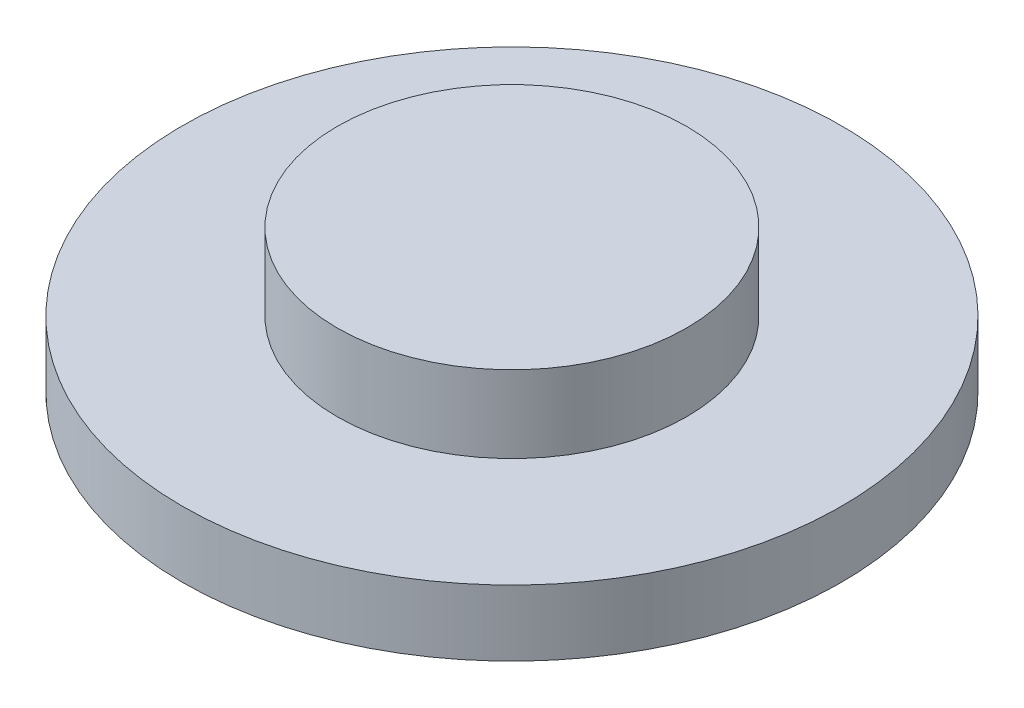
ISO-10303-21;
HEADER;
FILE_DESCRIPTION(('STEP AP214'),'2;1');
FILE_NAME('part.step','',(''),(''),'','','');
FILE_SCHEMA(('AUTOMOTIVE_DESIGN { 1 0 10303 214 1 1 1 1 }'));
ENDSEC;
DATA;
#1=APPLICATION_CONTEXT('core data for automotive mechanical design processes');
#2=APPLICATION_PROTOCOL_DEFINITION('international standard','automotive_design',2000,#1);
#3=PRODUCT_CONTEXT('',#1,'mechanical');
#4=PRODUCT('Part','Part','',(#3));
#5=PRODUCT_RELATED_PRODUCT_CATEGORY('part','',(#4));
#6=PRODUCT_DEFINITION_FORMATION('','',#4);
#7=PRODUCT_DEFINITION_CONTEXT('part definition',#1,'design');
#8=PRODUCT_DEFINITION('design','',#6,#7);
#9=PRODUCT_DEFINITION_SHAPE('','',#8);
#10=(LENGTH_UNIT() NAMED_UNIT(*) SI_UNIT(.MILLI.,.METRE.));
#11=(NAMED_UNIT(*) PLANE_ANGLE_UNIT() SI_UNIT($,.RADIAN.));
#12=(NAMED_UNIT(*) SI_UNIT($,.STERADIAN.) SOLID_ANGLE_UNIT());
#13=UNCERTAINTY_MEASURE_WITH_UNIT(LENGTH_MEASURE(1.E-05),#10,'distance_accuracy_value','');
#14=(GEOMETRIC_REPRESENTATION_CONTEXT(3) GLOBAL_UNCERTAINTY_ASSIGNED_CONTEXT((#13)) GLOBAL_UNIT_ASSIGNED_CONTEXT((#10,
#11,#12)) REPRESENTATION_CONTEXT('',''));
#15=CARTESIAN_POINT('',(0.,0.,0.));
#16=DIRECTION('',(0.,0.,1.));
#17=DIRECTION('',(1.,0.,0.));
#18=AXIS2_PLACEMENT_3D('',#15,#16,#17);
#19=CARTESIAN_POINT('',(0.,3.,0.));
#20=DIRECTION('',(0.,-1.,0.));
#21=DIRECTION('',(0.,0.,-1.));
#22=AXIS2_PLACEMENT_3D('',#19,#20,#21);
#23=CYLINDRICAL_SURFACE('',#22,15.);
#24=CARTESIAN_POINT('',(0.,3.,0.));
#25=DIRECTION('',(0.,1.,0.));
#26=DIRECTION('',(0.,0.,1.));
#27=AXIS2_PLACEMENT_3D('',#24,#25,#26);
#28=CIRCLE('',#27,15.);
#29=CARTESIAN_POINT('',(0.,3.,15.));
#30=VERTEX_POINT('',#29);
#31=EDGE_CURVE('E46',#30,#30,#28,.T.);
#32=ORIENTED_EDGE('',*,*,#31,.F.);
#33=EDGE_LOOP('',(#32));
#34=FACE_BOUND('',#33,.T.);
#35=CARTESIAN_POINT('',(0.,0.,0.));
#36=DIRECTION('',(0.,1.,0.));
#37=DIRECTION('',(0.,0.,1.));
#38=AXIS2_PLACEMENT_3D('',#35,#36,#37);
#39=CIRCLE('',#38,15.);
#40=CARTESIAN_POINT('',(0.,0.,15.));
#41=VERTEX_POINT('',#40);
#42=EDGE_CURVE('E42',#41,#41,#39,.T.);
#43=ORIENTED_EDGE('',*,*,#42,.T.);
#44=EDGE_LOOP('',(#43));
#45=FACE_BOUND('',#44,.T.);
#46=ADVANCED_FACE('F39',(#34,#45),#23,.T.);
#47=CARTESIAN_POINT('',(0.,3.,0.));
#48=DIRECTION('',(0.,1.,0.));
#49=DIRECTION('',(0.,0.,1.));
#50=AXIS2_PLACEMENT_3D('',#47,#48,#49);
#51=PLANE('',#50);
#52=CARTESIAN_POINT('',(0.,3.,0.));
#53=DIRECTION('',(0.,1.,0.));
#54=DIRECTION('',(0.,0.,1.));
#55=AXIS2_PLACEMENT_3D('',#52,#53,#54);
#56=CIRCLE('',#55,7.95);
#57=CARTESIAN_POINT('',(0.,3.,7.95));
#58=VERTEX_POINT('',#57);
#59=EDGE_CURVE('E10',#58,#58,#56,.T.);
#60=ORIENTED_EDGE('',*,*,#59,.F.);
#61=EDGE_LOOP('',(#60));
#62=FACE_BOUND('',#61,.T.);
#63=ORIENTED_EDGE('',*,*,#31,.T.);
#64=EDGE_LOOP('',(#63));
#65=FACE_BOUND('',#64,.T.);
#66=ADVANCED_FACE('F63',(#62,#65),#51,.T.);
#67=CARTESIAN_POINT('',(0.,0.,0.));
#68=DIRECTION('',(0.,1.,0.));
#69=DIRECTION('',(0.,0.,1.));
#70=AXIS2_PLACEMENT_3D('',#67,#68,#69);
#71=PLANE('',#70);
#72=ORIENTED_EDGE('',*,*,#42,.F.);
#73=EDGE_LOOP('',(#72));
#74=FACE_BOUND('',#73,.T.);
#75=ADVANCED_FACE('F60',(#74),#71,.F.);
#76=CARTESIAN_POINT('',(0.,6.5,0.));
#77=DIRECTION('',(0.,-1.,0.));
#78=DIRECTION('',(0.,0.,-1.));
#79=AXIS2_PLACEMENT_3D('',#76,#77,#78);
#80=CYLINDRICAL_SURFACE('',#79,7.95);
#81=CARTESIAN_POINT('',(0.,6.5,0.));
#82=DIRECTION('',(0.,1.,0.));
#83=DIRECTION('',(0.,0.,1.));
#84=AXIS2_PLACEMENT_3D('',#81,#82,#83);
#85=CIRCLE('',#84,7.95);
#86=CARTESIAN_POINT('',(0.,6.5,7.95));
#87=VERTEX_POINT('',#86);
#88=EDGE_CURVE('E52',#87,#87,#85,.T.);
#89=ORIENTED_EDGE('',*,*,#88,.F.);
#90=EDGE_LOOP('',(#89));
#91=FACE_BOUND('',#90,.T.);
#92=ORIENTED_EDGE('',*,*,#59,.T.);
#93=EDGE_LOOP('',(#92));
#94=FACE_BOUND('',#93,.T.);
#95=ADVANCED_FACE('F62',(#91,#94),#80,.T.);
#96=CARTESIAN_POINT('',(0.,6.5,0.));
#97=DIRECTION('',(0.,1.,0.));
#98=DIRECTION('',(0.,0.,1.));
#99=AXIS2_PLACEMENT_3D('',#96,#97,#98);
#100=PLANE('',#99);
#101=ORIENTED_EDGE('',*,*,#88,.T.);
#102=EDGE_LOOP('',(#101));
#103=FACE_BOUND('',#102,.T.);
#104=ADVANCED_FACE('F69',(#103),#100,.T.);
#105=CLOSED_SHELL('',(#46,#66,#75,#95,#104));
#106=MANIFOLD_SOLID_BREP('B2',#105);
#107=ADVANCED_BREP_SHAPE_REPRESENTATION('',(#18,#106),#14);
#108=SHAPE_DEFINITION_REPRESENTATION(#9,#107);
ENDSEC;
END-ISO-10303-21;
